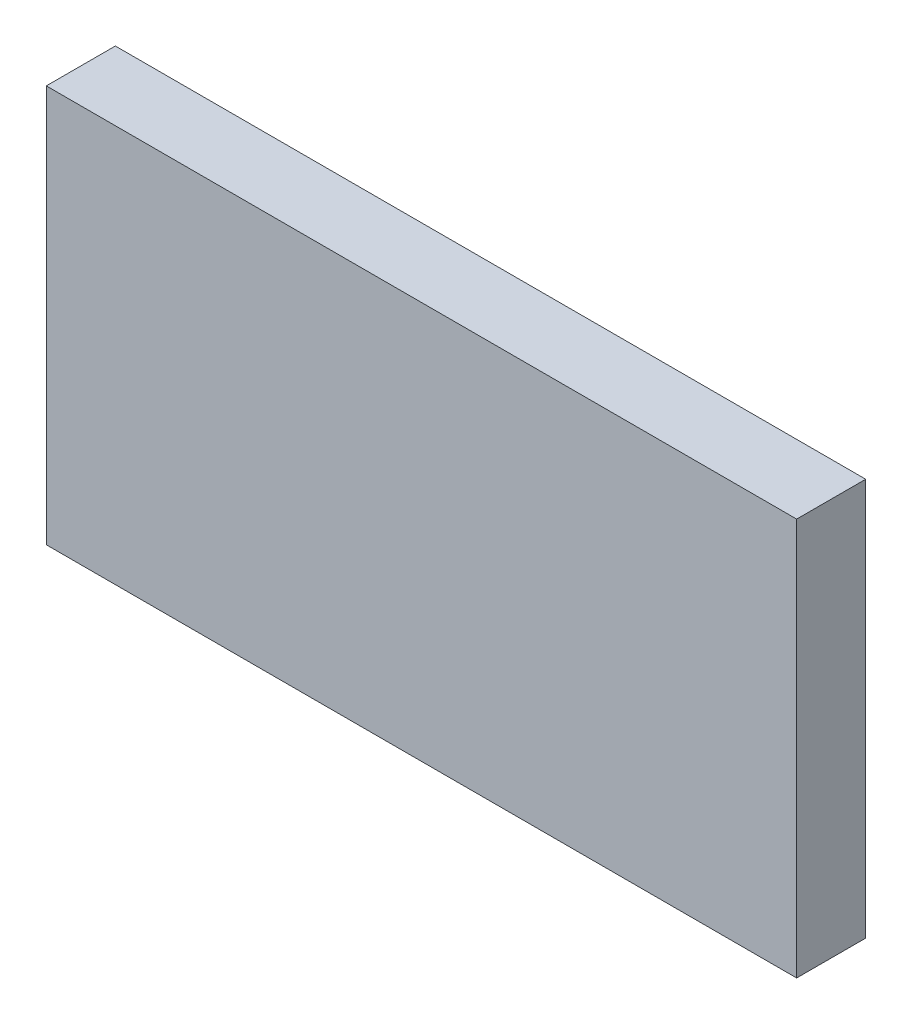
ISO-10303-21;
HEADER;
FILE_DESCRIPTION(('STEP AP214'),'2;1');
FILE_NAME('part.step','',(''),(''),'','','');
FILE_SCHEMA(('AUTOMOTIVE_DESIGN { 1 0 10303 214 1 1 1 1 }'));
ENDSEC;
DATA;
#1=APPLICATION_CONTEXT('core data for automotive mechanical design processes');
#2=APPLICATION_PROTOCOL_DEFINITION('international standard','automotive_design',2000,#1);
#3=PRODUCT_CONTEXT('',#1,'mechanical');
#4=PRODUCT('Part','Part','',(#3));
#5=PRODUCT_RELATED_PRODUCT_CATEGORY('part','',(#4));
#6=PRODUCT_DEFINITION_FORMATION('','',#4);
#7=PRODUCT_DEFINITION_CONTEXT('part definition',#1,'design');
#8=PRODUCT_DEFINITION('design','',#6,#7);
#9=PRODUCT_DEFINITION_SHAPE('','',#8);
#10=(LENGTH_UNIT() NAMED_UNIT(*) SI_UNIT(.MILLI.,.METRE.));
#11=(NAMED_UNIT(*) PLANE_ANGLE_UNIT() SI_UNIT($,.RADIAN.));
#12=(NAMED_UNIT(*) SI_UNIT($,.STERADIAN.) SOLID_ANGLE_UNIT());
#13=UNCERTAINTY_MEASURE_WITH_UNIT(LENGTH_MEASURE(1.E-05),#10,'distance_accuracy_value','');
#14=(GEOMETRIC_REPRESENTATION_CONTEXT(3) GLOBAL_UNCERTAINTY_ASSIGNED_CONTEXT((#13)) GLOBAL_UNIT_ASSIGNED_CONTEXT((#10,
#11,#12)) REPRESENTATION_CONTEXT('',''));
#15=CARTESIAN_POINT('',(0.,0.,0.));
#16=DIRECTION('',(0.,0.,1.));
#17=DIRECTION('',(1.,0.,0.));
#18=AXIS2_PLACEMENT_3D('',#15,#16,#17);
#19=CARTESIAN_POINT('',(54.3341539909049,28.7785714285714,10.));
#20=DIRECTION('',(-1.,0.,0.));
#21=DIRECTION('',(0.,0.,1.));
#22=AXIS2_PLACEMENT_3D('',#19,#20,#21);
#23=PLANE('',#22);
#24=DIRECTION('',(0.,1.,0.));
#25=VECTOR('',#24,1.);
#26=CARTESIAN_POINT('',(54.3341539909049,28.7785714285714,0.));
#27=LINE('',#26,#25);
#28=CARTESIAN_POINT('',(54.3341539909049,-28.7785714285714,0.));
#29=VERTEX_POINT('',#28);
#30=CARTESIAN_POINT('',(54.3341539909049,28.7785714285714,0.));
#31=VERTEX_POINT('',#30);
#32=EDGE_CURVE('E96',#29,#31,#27,.T.);
#33=ORIENTED_EDGE('',*,*,#32,.T.);
#34=DIRECTION('',(0.,0.,-1.));
#35=VECTOR('',#34,1.);
#36=CARTESIAN_POINT('',(54.3341539909049,28.7785714285714,10.));
#37=LINE('',#36,#35);
#38=CARTESIAN_POINT('',(54.3341539909049,28.7785714285714,10.));
#39=VERTEX_POINT('',#38);
#40=EDGE_CURVE('E11',#39,#31,#37,.T.);
#41=ORIENTED_EDGE('',*,*,#40,.F.);
#42=DIRECTION('',(0.,1.,0.));
#43=VECTOR('',#42,1.);
#44=CARTESIAN_POINT('',(54.3341539909049,28.7785714285714,10.));
#45=LINE('',#44,#43);
#46=CARTESIAN_POINT('',(54.3341539909049,-28.7785714285714,10.));
#47=VERTEX_POINT('',#46);
#48=EDGE_CURVE('E84',#47,#39,#45,.T.);
#49=ORIENTED_EDGE('',*,*,#48,.F.);
#50=DIRECTION('',(0.,0.,-1.));
#51=VECTOR('',#50,1.);
#52=CARTESIAN_POINT('',(54.3341539909049,-28.7785714285714,10.));
#53=LINE('',#52,#51);
#54=EDGE_CURVE('E92',#47,#29,#53,.T.);
#55=ORIENTED_EDGE('',*,*,#54,.T.);
#56=EDGE_LOOP('',(#33,#41,#49,#55));
#57=FACE_BOUND('',#56,.T.);
#58=ADVANCED_FACE('F33',(#57),#23,.F.);
#59=CARTESIAN_POINT('',(-54.3341539909049,28.7785714285714,10.));
#60=DIRECTION('',(0.,-1.,0.));
#61=DIRECTION('',(0.,0.,-1.));
#62=AXIS2_PLACEMENT_3D('',#59,#60,#61);
#63=PLANE('',#62);
#64=DIRECTION('',(-1.,0.,0.));
#65=VECTOR('',#64,1.);
#66=CARTESIAN_POINT('',(-54.3341539909049,28.7785714285714,0.));
#67=LINE('',#66,#65);
#68=CARTESIAN_POINT('',(-54.3341539909049,28.7785714285714,0.));
#69=VERTEX_POINT('',#68);
#70=EDGE_CURVE('E88',#31,#69,#67,.T.);
#71=ORIENTED_EDGE('',*,*,#70,.T.);
#72=DIRECTION('',(0.,0.,-1.));
#73=VECTOR('',#72,1.);
#74=CARTESIAN_POINT('',(-54.3341539909049,28.7785714285714,10.));
#75=LINE('',#74,#73);
#76=CARTESIAN_POINT('',(-54.3341539909049,28.7785714285714,10.));
#77=VERTEX_POINT('',#76);
#78=EDGE_CURVE('E41',#77,#69,#75,.T.);
#79=ORIENTED_EDGE('',*,*,#78,.F.);
#80=DIRECTION('',(-1.,0.,0.));
#81=VECTOR('',#80,1.);
#82=CARTESIAN_POINT('',(-54.3341539909049,28.7785714285714,10.));
#83=LINE('',#82,#81);
#84=EDGE_CURVE('E79',#39,#77,#83,.T.);
#85=ORIENTED_EDGE('',*,*,#84,.F.);
#86=ORIENTED_EDGE('',*,*,#40,.T.);
#87=EDGE_LOOP('',(#71,#79,#85,#86));
#88=FACE_BOUND('',#87,.T.);
#89=ADVANCED_FACE('F87',(#88),#63,.F.);
#90=CARTESIAN_POINT('',(-54.3341539909049,28.7785714285714,10.));
#91=DIRECTION('',(1.,0.,0.));
#92=DIRECTION('',(0.,0.,-1.));
#93=AXIS2_PLACEMENT_3D('',#90,#91,#92);
#94=PLANE('',#93);
#95=DIRECTION('',(0.,-1.,0.));
#96=VECTOR('',#95,1.);
#97=CARTESIAN_POINT('',(-54.3341539909049,28.7785714285714,0.));
#98=LINE('',#97,#96);
#99=CARTESIAN_POINT('',(-54.3341539909049,-28.7785714285714,0.));
#100=VERTEX_POINT('',#99);
#101=EDGE_CURVE('E66',#69,#100,#98,.T.);
#102=ORIENTED_EDGE('',*,*,#101,.T.);
#103=DIRECTION('',(0.,0.,-1.));
#104=VECTOR('',#103,1.);
#105=CARTESIAN_POINT('',(-54.3341539909049,-28.7785714285714,10.));
#106=LINE('',#105,#104);
#107=CARTESIAN_POINT('',(-54.3341539909049,-28.7785714285714,10.));
#108=VERTEX_POINT('',#107);
#109=EDGE_CURVE('E89',#108,#100,#106,.T.);
#110=ORIENTED_EDGE('',*,*,#109,.F.);
#111=DIRECTION('',(0.,-1.,0.));
#112=VECTOR('',#111,1.);
#113=CARTESIAN_POINT('',(-54.3341539909049,28.7785714285714,10.));
#114=LINE('',#113,#112);
#115=EDGE_CURVE('E82',#77,#108,#114,.T.);
#116=ORIENTED_EDGE('',*,*,#115,.F.);
#117=ORIENTED_EDGE('',*,*,#78,.T.);
#118=EDGE_LOOP('',(#102,#110,#116,#117));
#119=FACE_BOUND('',#118,.T.);
#120=ADVANCED_FACE('F90',(#119),#94,.F.);
#121=CARTESIAN_POINT('',(-54.3341539909049,-28.7785714285714,10.));
#122=DIRECTION('',(0.,1.,0.));
#123=DIRECTION('',(0.,0.,1.));
#124=AXIS2_PLACEMENT_3D('',#121,#122,#123);
#125=PLANE('',#124);
#126=DIRECTION('',(1.,0.,0.));
#127=VECTOR('',#126,1.);
#128=CARTESIAN_POINT('',(-54.3341539909049,-28.7785714285714,0.));
#129=LINE('',#128,#127);
#130=EDGE_CURVE('E72',#100,#29,#129,.T.);
#131=ORIENTED_EDGE('',*,*,#130,.T.);
#132=ORIENTED_EDGE('',*,*,#54,.F.);
#133=DIRECTION('',(1.,0.,0.));
#134=VECTOR('',#133,1.);
#135=CARTESIAN_POINT('',(-54.3341539909049,-28.7785714285714,10.));
#136=LINE('',#135,#134);
#137=EDGE_CURVE('E49',#108,#47,#136,.T.);
#138=ORIENTED_EDGE('',*,*,#137,.F.);
#139=ORIENTED_EDGE('',*,*,#109,.T.);
#140=EDGE_LOOP('',(#131,#132,#138,#139));
#141=FACE_BOUND('',#140,.T.);
#142=ADVANCED_FACE('F103',(#141),#125,.F.);
#143=CARTESIAN_POINT('',(0.,0.,10.));
#144=DIRECTION('',(0.,0.,1.));
#145=DIRECTION('',(1.,0.,0.));
#146=AXIS2_PLACEMENT_3D('',#143,#144,#145);
#147=PLANE('',#146);
#148=ORIENTED_EDGE('',*,*,#48,.T.);
#149=ORIENTED_EDGE('',*,*,#84,.T.);
#150=ORIENTED_EDGE('',*,*,#115,.T.);
#151=ORIENTED_EDGE('',*,*,#137,.T.);
#152=EDGE_LOOP('',(#148,#149,#150,#151));
#153=FACE_BOUND('',#152,.T.);
#154=ADVANCED_FACE('F80',(#153),#147,.T.);
#155=CARTESIAN_POINT('',(0.,0.,0.));
#156=DIRECTION('',(0.,0.,1.));
#157=DIRECTION('',(1.,0.,0.));
#158=AXIS2_PLACEMENT_3D('',#155,#156,#157);
#159=PLANE('',#158);
#160=ORIENTED_EDGE('',*,*,#32,.F.);
#161=ORIENTED_EDGE('',*,*,#130,.F.);
#162=ORIENTED_EDGE('',*,*,#101,.F.);
#163=ORIENTED_EDGE('',*,*,#70,.F.);
#164=EDGE_LOOP('',(#160,#161,#162,#163));
#165=FACE_BOUND('',#164,.T.);
#166=ADVANCED_FACE('F106',(#165),#159,.F.);
#167=CLOSED_SHELL('',(#58,#89,#120,#142,#154,#166));
#168=MANIFOLD_SOLID_BREP('B2',#167);
#169=ADVANCED_BREP_SHAPE_REPRESENTATION('',(#18,#168),#14);
#170=SHAPE_DEFINITION_REPRESENTATION(#9,#169);
ENDSEC;
END-ISO-10303-21;
